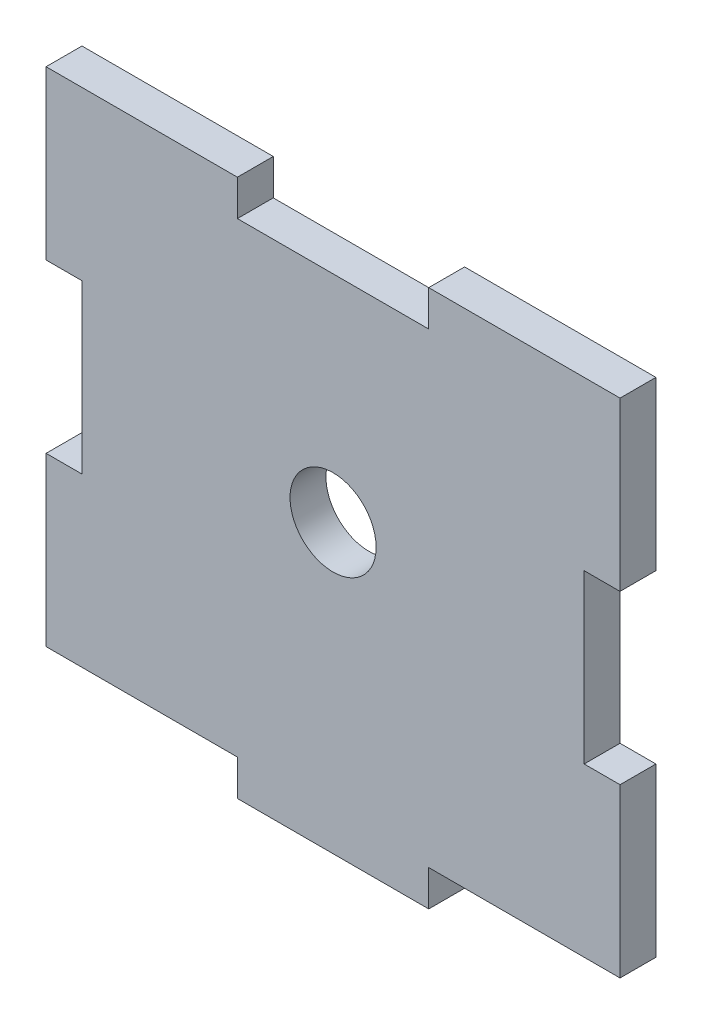
ISO-10303-21;
HEADER;
FILE_DESCRIPTION(('STEP AP214'),'2;1');
FILE_NAME('part.step','',(''),(''),'','','');
FILE_SCHEMA(('AUTOMOTIVE_DESIGN { 1 0 10303 214 1 1 1 1 }'));
ENDSEC;
DATA;
#1=APPLICATION_CONTEXT('core data for automotive mechanical design processes');
#2=APPLICATION_PROTOCOL_DEFINITION('international standard','automotive_design',2000,#1);
#3=PRODUCT_CONTEXT('',#1,'mechanical');
#4=PRODUCT('Part','Part','',(#3));
#5=PRODUCT_RELATED_PRODUCT_CATEGORY('part','',(#4));
#6=PRODUCT_DEFINITION_FORMATION('','',#4);
#7=PRODUCT_DEFINITION_CONTEXT('part definition',#1,'design');
#8=PRODUCT_DEFINITION('design','',#6,#7);
#9=PRODUCT_DEFINITION_SHAPE('','',#8);
#10=(LENGTH_UNIT() NAMED_UNIT(*) SI_UNIT(.MILLI.,.METRE.));
#11=(NAMED_UNIT(*) PLANE_ANGLE_UNIT() SI_UNIT($,.RADIAN.));
#12=(NAMED_UNIT(*) SI_UNIT($,.STERADIAN.) SOLID_ANGLE_UNIT());
#13=UNCERTAINTY_MEASURE_WITH_UNIT(LENGTH_MEASURE(1.E-05),#10,'distance_accuracy_value','');
#14=(GEOMETRIC_REPRESENTATION_CONTEXT(3) GLOBAL_UNCERTAINTY_ASSIGNED_CONTEXT((#13)) GLOBAL_UNIT_ASSIGNED_CONTEXT((#10,
#11,#12)) REPRESENTATION_CONTEXT('',''));
#15=CARTESIAN_POINT('',(0.,0.,0.));
#16=DIRECTION('',(0.,0.,1.));
#17=DIRECTION('',(1.,0.,0.));
#18=AXIS2_PLACEMENT_3D('',#15,#16,#17);
#19=CARTESIAN_POINT('',(0.,75.,5.));
#20=DIRECTION('',(0.,1.,0.));
#21=DIRECTION('',(-1.,0.,0.));
#22=AXIS2_PLACEMENT_3D('',#19,#20,#21);
#23=PLANE('',#22);
#24=DIRECTION('',(0.,0.,1.));
#25=VECTOR('',#24,1.);
#26=CARTESIAN_POINT('',(53.3333333333333,75.,-5.));
#27=LINE('',#26,#25);
#28=CARTESIAN_POINT('',(53.3333333333333,75.,0.));
#29=VERTEX_POINT('',#28);
#30=CARTESIAN_POINT('',(53.3333333333333,75.,5.));
#31=VERTEX_POINT('',#30);
#32=EDGE_CURVE('E297',#29,#31,#27,.T.);
#33=ORIENTED_EDGE('',*,*,#32,.T.);
#34=DIRECTION('',(1.,0.,0.));
#35=VECTOR('',#34,1.);
#36=CARTESIAN_POINT('',(0.,75.,5.));
#37=LINE('',#36,#35);
#38=CARTESIAN_POINT('',(80.,75.,5.));
#39=VERTEX_POINT('',#38);
#40=EDGE_CURVE('E182',#31,#39,#37,.T.);
#41=ORIENTED_EDGE('',*,*,#40,.T.);
#42=DIRECTION('',(0.,0.,-1.));
#43=VECTOR('',#42,1.);
#44=CARTESIAN_POINT('',(80.,75.,5.));
#45=LINE('',#44,#43);
#46=CARTESIAN_POINT('',(80.,75.,0.));
#47=VERTEX_POINT('',#46);
#48=EDGE_CURVE('E173',#39,#47,#45,.T.);
#49=ORIENTED_EDGE('',*,*,#48,.T.);
#50=DIRECTION('',(1.,0.,0.));
#51=VECTOR('',#50,1.);
#52=CARTESIAN_POINT('',(0.,75.,0.));
#53=LINE('',#52,#51);
#54=EDGE_CURVE('E232',#29,#47,#53,.T.);
#55=ORIENTED_EDGE('',*,*,#54,.F.);
#56=EDGE_LOOP('',(#33,#41,#49,#55));
#57=FACE_BOUND('',#56,.T.);
#58=ADVANCED_FACE('F34',(#57),#23,.T.);
#59=CARTESIAN_POINT('',(0.,0.,5.));
#60=DIRECTION('',(-1.,0.,0.));
#61=DIRECTION('',(0.,0.,1.));
#62=AXIS2_PLACEMENT_3D('',#59,#60,#61);
#63=PLANE('',#62);
#64=DIRECTION('',(0.,1.,0.));
#65=VECTOR('',#64,1.);
#66=CARTESIAN_POINT('',(0.,0.,0.));
#67=LINE('',#66,#65);
#68=CARTESIAN_POINT('',(0.,51.6666666666667,0.));
#69=VERTEX_POINT('',#68);
#70=CARTESIAN_POINT('',(0.,75.,0.));
#71=VERTEX_POINT('',#70);
#72=EDGE_CURVE('E196',#69,#71,#67,.T.);
#73=ORIENTED_EDGE('',*,*,#72,.F.);
#74=DIRECTION('',(0.,0.,-1.));
#75=VECTOR('',#74,1.);
#76=CARTESIAN_POINT('',(0.,51.6666666666667,5.));
#77=LINE('',#76,#75);
#78=CARTESIAN_POINT('',(0.,51.6666666666667,5.));
#79=VERTEX_POINT('',#78);
#80=EDGE_CURVE('E119',#79,#69,#77,.T.);
#81=ORIENTED_EDGE('',*,*,#80,.F.);
#82=DIRECTION('',(0.,1.,0.));
#83=VECTOR('',#82,1.);
#84=CARTESIAN_POINT('',(0.,0.,5.));
#85=LINE('',#84,#83);
#86=CARTESIAN_POINT('',(0.,75.,5.));
#87=VERTEX_POINT('',#86);
#88=EDGE_CURVE('E236',#79,#87,#85,.T.);
#89=ORIENTED_EDGE('',*,*,#88,.T.);
#90=DIRECTION('',(0.,0.,-1.));
#91=VECTOR('',#90,1.);
#92=CARTESIAN_POINT('',(0.,75.,5.));
#93=LINE('',#92,#91);
#94=EDGE_CURVE('E59',#87,#71,#93,.T.);
#95=ORIENTED_EDGE('',*,*,#94,.T.);
#96=EDGE_LOOP('',(#73,#81,#89,#95));
#97=FACE_BOUND('',#96,.T.);
#98=ADVANCED_FACE('F36',(#97),#63,.T.);
#99=CARTESIAN_POINT('',(0.,51.6666666666667,5.));
#100=DIRECTION('',(0.,1.,0.));
#101=DIRECTION('',(0.,0.,1.));
#102=AXIS2_PLACEMENT_3D('',#99,#100,#101);
#103=PLANE('',#102);
#104=DIRECTION('',(1.,0.,0.));
#105=VECTOR('',#104,1.);
#106=CARTESIAN_POINT('',(0.,51.6666666666667,0.));
#107=LINE('',#106,#105);
#108=CARTESIAN_POINT('',(5.,51.6666666666667,0.));
#109=VERTEX_POINT('',#108);
#110=EDGE_CURVE('E198',#69,#109,#107,.T.);
#111=ORIENTED_EDGE('',*,*,#110,.T.);
#112=DIRECTION('',(0.,0.,-1.));
#113=VECTOR('',#112,1.);
#114=CARTESIAN_POINT('',(5.,51.6666666666667,5.));
#115=LINE('',#114,#113);
#116=CARTESIAN_POINT('',(5.,51.6666666666667,5.));
#117=VERTEX_POINT('',#116);
#118=EDGE_CURVE('E264',#117,#109,#115,.T.);
#119=ORIENTED_EDGE('',*,*,#118,.F.);
#120=DIRECTION('',(1.,0.,0.));
#121=VECTOR('',#120,1.);
#122=CARTESIAN_POINT('',(0.,51.6666666666667,5.));
#123=LINE('',#122,#121);
#124=EDGE_CURVE('E301',#79,#117,#123,.T.);
#125=ORIENTED_EDGE('',*,*,#124,.F.);
#126=ORIENTED_EDGE('',*,*,#80,.T.);
#127=EDGE_LOOP('',(#111,#119,#125,#126));
#128=FACE_BOUND('',#127,.T.);
#129=ADVANCED_FACE('F350',(#128),#103,.F.);
#130=CARTESIAN_POINT('',(5.00000000000001,0.,5.));
#131=DIRECTION('',(1.,0.,0.));
#132=DIRECTION('',(0.,1.,0.));
#133=AXIS2_PLACEMENT_3D('',#130,#131,#132);
#134=PLANE('',#133);
#135=DIRECTION('',(0.,-1.,0.));
#136=VECTOR('',#135,1.);
#137=CARTESIAN_POINT('',(5.00000000000001,0.,0.));
#138=LINE('',#137,#136);
#139=CARTESIAN_POINT('',(5.,28.3333333333333,0.));
#140=VERTEX_POINT('',#139);
#141=EDGE_CURVE('E201',#109,#140,#138,.T.);
#142=ORIENTED_EDGE('',*,*,#141,.T.);
#143=DIRECTION('',(0.,0.,-1.));
#144=VECTOR('',#143,1.);
#145=CARTESIAN_POINT('',(5.,28.3333333333333,5.));
#146=LINE('',#145,#144);
#147=CARTESIAN_POINT('',(5.,28.3333333333333,5.));
#148=VERTEX_POINT('',#147);
#149=EDGE_CURVE('E262',#148,#140,#146,.T.);
#150=ORIENTED_EDGE('',*,*,#149,.F.);
#151=DIRECTION('',(0.,-1.,0.));
#152=VECTOR('',#151,1.);
#153=CARTESIAN_POINT('',(5.00000000000001,0.,5.));
#154=LINE('',#153,#152);
#155=EDGE_CURVE('E303',#117,#148,#154,.T.);
#156=ORIENTED_EDGE('',*,*,#155,.F.);
#157=ORIENTED_EDGE('',*,*,#118,.T.);
#158=EDGE_LOOP('',(#142,#150,#156,#157));
#159=FACE_BOUND('',#158,.T.);
#160=ADVANCED_FACE('F355',(#159),#134,.F.);
#161=CARTESIAN_POINT('',(0.,28.3333333333333,5.));
#162=DIRECTION('',(0.,1.,0.));
#163=DIRECTION('',(0.,0.,1.));
#164=AXIS2_PLACEMENT_3D('',#161,#162,#163);
#165=PLANE('',#164);
#166=DIRECTION('',(1.,0.,0.));
#167=VECTOR('',#166,1.);
#168=CARTESIAN_POINT('',(0.,28.3333333333333,0.));
#169=LINE('',#168,#167);
#170=CARTESIAN_POINT('',(0.,28.3333333333333,0.));
#171=VERTEX_POINT('',#170);
#172=EDGE_CURVE('E204',#171,#140,#169,.T.);
#173=ORIENTED_EDGE('',*,*,#172,.F.);
#174=DIRECTION('',(0.,0.,-1.));
#175=VECTOR('',#174,1.);
#176=CARTESIAN_POINT('',(0.,28.3333333333333,5.));
#177=LINE('',#176,#175);
#178=CARTESIAN_POINT('',(0.,28.3333333333333,5.));
#179=VERTEX_POINT('',#178);
#180=EDGE_CURVE('E260',#179,#171,#177,.T.);
#181=ORIENTED_EDGE('',*,*,#180,.F.);
#182=DIRECTION('',(1.,0.,0.));
#183=VECTOR('',#182,1.);
#184=CARTESIAN_POINT('',(0.,28.3333333333333,5.));
#185=LINE('',#184,#183);
#186=EDGE_CURVE('E305',#179,#148,#185,.T.);
#187=ORIENTED_EDGE('',*,*,#186,.T.);
#188=ORIENTED_EDGE('',*,*,#149,.T.);
#189=EDGE_LOOP('',(#173,#181,#187,#188));
#190=FACE_BOUND('',#189,.T.);
#191=ADVANCED_FACE('F402',(#190),#165,.T.);
#192=CARTESIAN_POINT('',(0.,0.,5.));
#193=DIRECTION('',(-1.,0.,0.));
#194=DIRECTION('',(0.,0.,1.));
#195=AXIS2_PLACEMENT_3D('',#192,#193,#194);
#196=PLANE('',#195);
#197=DIRECTION('',(0.,1.,0.));
#198=VECTOR('',#197,1.);
#199=CARTESIAN_POINT('',(0.,0.,0.));
#200=LINE('',#199,#198);
#201=CARTESIAN_POINT('',(0.,5.,0.));
#202=VERTEX_POINT('',#201);
#203=EDGE_CURVE('E207',#202,#171,#200,.T.);
#204=ORIENTED_EDGE('',*,*,#203,.F.);
#205=DIRECTION('',(0.,0.,-1.));
#206=VECTOR('',#205,1.);
#207=CARTESIAN_POINT('',(0.,5.,5.));
#208=LINE('',#207,#206);
#209=CARTESIAN_POINT('',(0.,5.,5.));
#210=VERTEX_POINT('',#209);
#211=EDGE_CURVE('E258',#210,#202,#208,.T.);
#212=ORIENTED_EDGE('',*,*,#211,.F.);
#213=DIRECTION('',(0.,1.,0.));
#214=VECTOR('',#213,1.);
#215=CARTESIAN_POINT('',(0.,0.,5.));
#216=LINE('',#215,#214);
#217=EDGE_CURVE('E308',#210,#179,#216,.T.);
#218=ORIENTED_EDGE('',*,*,#217,.T.);
#219=ORIENTED_EDGE('',*,*,#180,.T.);
#220=EDGE_LOOP('',(#204,#212,#218,#219));
#221=FACE_BOUND('',#220,.T.);
#222=ADVANCED_FACE('F399',(#221),#196,.T.);
#223=CARTESIAN_POINT('',(0.,5.,5.));
#224=DIRECTION('',(0.,1.,0.));
#225=DIRECTION('',(0.,0.,1.));
#226=AXIS2_PLACEMENT_3D('',#223,#224,#225);
#227=PLANE('',#226);
#228=DIRECTION('',(1.,0.,0.));
#229=VECTOR('',#228,1.);
#230=CARTESIAN_POINT('',(0.,5.,0.));
#231=LINE('',#230,#229);
#232=CARTESIAN_POINT('',(26.6666666666667,5.,0.));
#233=VERTEX_POINT('',#232);
#234=EDGE_CURVE('E210',#202,#233,#231,.T.);
#235=ORIENTED_EDGE('',*,*,#234,.T.);
#236=DIRECTION('',(0.,0.,-1.));
#237=VECTOR('',#236,1.);
#238=CARTESIAN_POINT('',(26.6666666666667,5.,5.));
#239=LINE('',#238,#237);
#240=CARTESIAN_POINT('',(26.6666666666667,5.,5.));
#241=VERTEX_POINT('',#240);
#242=EDGE_CURVE('E255',#241,#233,#239,.T.);
#243=ORIENTED_EDGE('',*,*,#242,.F.);
#244=DIRECTION('',(1.,0.,0.));
#245=VECTOR('',#244,1.);
#246=CARTESIAN_POINT('',(0.,5.,5.));
#247=LINE('',#246,#245);
#248=EDGE_CURVE('E311',#210,#241,#247,.T.);
#249=ORIENTED_EDGE('',*,*,#248,.F.);
#250=ORIENTED_EDGE('',*,*,#211,.T.);
#251=EDGE_LOOP('',(#235,#243,#249,#250));
#252=FACE_BOUND('',#251,.T.);
#253=ADVANCED_FACE('F387',(#252),#227,.F.);
#254=CARTESIAN_POINT('',(26.6666666666667,0.,5.));
#255=DIRECTION('',(1.,0.,0.));
#256=DIRECTION('',(0.,0.,-1.));
#257=AXIS2_PLACEMENT_3D('',#254,#255,#256);
#258=PLANE('',#257);
#259=DIRECTION('',(0.,-1.,0.));
#260=VECTOR('',#259,1.);
#261=CARTESIAN_POINT('',(26.6666666666667,0.,0.));
#262=LINE('',#261,#260);
#263=CARTESIAN_POINT('',(26.6666666666667,0.,0.));
#264=VERTEX_POINT('',#263);
#265=EDGE_CURVE('E212',#233,#264,#262,.T.);
#266=ORIENTED_EDGE('',*,*,#265,.T.);
#267=DIRECTION('',(0.,0.,-1.));
#268=VECTOR('',#267,1.);
#269=CARTESIAN_POINT('',(26.6666666666667,0.,5.));
#270=LINE('',#269,#268);
#271=CARTESIAN_POINT('',(26.6666666666667,0.,5.));
#272=VERTEX_POINT('',#271);
#273=EDGE_CURVE('E252',#272,#264,#270,.T.);
#274=ORIENTED_EDGE('',*,*,#273,.F.);
#275=DIRECTION('',(0.,-1.,0.));
#276=VECTOR('',#275,1.);
#277=CARTESIAN_POINT('',(26.6666666666667,0.,5.));
#278=LINE('',#277,#276);
#279=EDGE_CURVE('E313',#241,#272,#278,.T.);
#280=ORIENTED_EDGE('',*,*,#279,.F.);
#281=ORIENTED_EDGE('',*,*,#242,.T.);
#282=EDGE_LOOP('',(#266,#274,#280,#281));
#283=FACE_BOUND('',#282,.T.);
#284=ADVANCED_FACE('F394',(#283),#258,.F.);
#285=CARTESIAN_POINT('',(0.,0.,5.));
#286=DIRECTION('',(0.,1.,0.));
#287=DIRECTION('',(0.,0.,1.));
#288=AXIS2_PLACEMENT_3D('',#285,#286,#287);
#289=PLANE('',#288);
#290=DIRECTION('',(1.,0.,0.));
#291=VECTOR('',#290,1.);
#292=CARTESIAN_POINT('',(0.,0.,0.));
#293=LINE('',#292,#291);
#294=CARTESIAN_POINT('',(53.3333333333333,0.,0.));
#295=VERTEX_POINT('',#294);
#296=EDGE_CURVE('E215',#264,#295,#293,.T.);
#297=ORIENTED_EDGE('',*,*,#296,.T.);
#298=DIRECTION('',(0.,0.,-1.));
#299=VECTOR('',#298,1.);
#300=CARTESIAN_POINT('',(53.3333333333333,0.,5.));
#301=LINE('',#300,#299);
#302=CARTESIAN_POINT('',(53.3333333333333,0.,5.));
#303=VERTEX_POINT('',#302);
#304=EDGE_CURVE('E250',#303,#295,#301,.T.);
#305=ORIENTED_EDGE('',*,*,#304,.F.);
#306=DIRECTION('',(1.,0.,0.));
#307=VECTOR('',#306,1.);
#308=CARTESIAN_POINT('',(0.,0.,5.));
#309=LINE('',#308,#307);
#310=EDGE_CURVE('E316',#272,#303,#309,.T.);
#311=ORIENTED_EDGE('',*,*,#310,.F.);
#312=ORIENTED_EDGE('',*,*,#273,.T.);
#313=EDGE_LOOP('',(#297,#305,#311,#312));
#314=FACE_BOUND('',#313,.T.);
#315=ADVANCED_FACE('F390',(#314),#289,.F.);
#316=CARTESIAN_POINT('',(53.3333333333333,0.,5.));
#317=DIRECTION('',(1.,0.,0.));
#318=DIRECTION('',(0.,0.,-1.));
#319=AXIS2_PLACEMENT_3D('',#316,#317,#318);
#320=PLANE('',#319);
#321=DIRECTION('',(0.,-1.,0.));
#322=VECTOR('',#321,1.);
#323=CARTESIAN_POINT('',(53.3333333333333,0.,0.));
#324=LINE('',#323,#322);
#325=CARTESIAN_POINT('',(53.3333333333333,5.,0.));
#326=VERTEX_POINT('',#325);
#327=EDGE_CURVE('E218',#326,#295,#324,.T.);
#328=ORIENTED_EDGE('',*,*,#327,.F.);
#329=DIRECTION('',(0.,0.,-1.));
#330=VECTOR('',#329,1.);
#331=CARTESIAN_POINT('',(53.3333333333333,5.,5.));
#332=LINE('',#331,#330);
#333=CARTESIAN_POINT('',(53.3333333333333,5.,5.));
#334=VERTEX_POINT('',#333);
#335=EDGE_CURVE('E248',#334,#326,#332,.T.);
#336=ORIENTED_EDGE('',*,*,#335,.F.);
#337=DIRECTION('',(0.,-1.,0.));
#338=VECTOR('',#337,1.);
#339=CARTESIAN_POINT('',(53.3333333333333,0.,5.));
#340=LINE('',#339,#338);
#341=EDGE_CURVE('E318',#334,#303,#340,.T.);
#342=ORIENTED_EDGE('',*,*,#341,.T.);
#343=ORIENTED_EDGE('',*,*,#304,.T.);
#344=EDGE_LOOP('',(#328,#336,#342,#343));
#345=FACE_BOUND('',#344,.T.);
#346=ADVANCED_FACE('F385',(#345),#320,.T.);
#347=CARTESIAN_POINT('',(80.,5.,0.));
#348=VERTEX_POINT('',#347);
#349=EDGE_CURVE('E213',#326,#348,#231,.T.);
#350=ORIENTED_EDGE('',*,*,#349,.T.);
#351=DIRECTION('',(0.,0.,-1.));
#352=VECTOR('',#351,1.);
#353=CARTESIAN_POINT('',(80.,5.,5.));
#354=LINE('',#353,#352);
#355=CARTESIAN_POINT('',(80.,5.,5.));
#356=VERTEX_POINT('',#355);
#357=EDGE_CURVE('E245',#356,#348,#354,.T.);
#358=ORIENTED_EDGE('',*,*,#357,.F.);
#359=EDGE_CURVE('E314',#334,#356,#247,.T.);
#360=ORIENTED_EDGE('',*,*,#359,.F.);
#361=ORIENTED_EDGE('',*,*,#335,.T.);
#362=EDGE_LOOP('',(#350,#358,#360,#361));
#363=FACE_BOUND('',#362,.T.);
#364=ADVANCED_FACE('F381',(#363),#227,.F.);
#365=CARTESIAN_POINT('',(80.,0.,5.));
#366=DIRECTION('',(-1.,0.,0.));
#367=DIRECTION('',(0.,0.,1.));
#368=AXIS2_PLACEMENT_3D('',#365,#366,#367);
#369=PLANE('',#368);
#370=DIRECTION('',(0.,1.,0.));
#371=VECTOR('',#370,1.);
#372=CARTESIAN_POINT('',(80.,0.,0.));
#373=LINE('',#372,#371);
#374=CARTESIAN_POINT('',(80.,28.3333333333333,0.));
#375=VERTEX_POINT('',#374);
#376=EDGE_CURVE('E221',#348,#375,#373,.T.);
#377=ORIENTED_EDGE('',*,*,#376,.T.);
#378=DIRECTION('',(0.,0.,-1.));
#379=VECTOR('',#378,1.);
#380=CARTESIAN_POINT('',(80.,28.3333333333333,5.));
#381=LINE('',#380,#379);
#382=CARTESIAN_POINT('',(80.,28.3333333333333,5.));
#383=VERTEX_POINT('',#382);
#384=EDGE_CURVE('E242',#383,#375,#381,.T.);
#385=ORIENTED_EDGE('',*,*,#384,.F.);
#386=DIRECTION('',(0.,1.,0.));
#387=VECTOR('',#386,1.);
#388=CARTESIAN_POINT('',(80.,0.,5.));
#389=LINE('',#388,#387);
#390=EDGE_CURVE('E321',#356,#383,#389,.T.);
#391=ORIENTED_EDGE('',*,*,#390,.F.);
#392=ORIENTED_EDGE('',*,*,#357,.T.);
#393=EDGE_LOOP('',(#377,#385,#391,#392));
#394=FACE_BOUND('',#393,.T.);
#395=ADVANCED_FACE('F378',(#394),#369,.F.);
#396=CARTESIAN_POINT('',(0.,28.3333333333333,5.));
#397=DIRECTION('',(0.,-1.,0.));
#398=DIRECTION('',(1.,0.,0.));
#399=AXIS2_PLACEMENT_3D('',#396,#397,#398);
#400=PLANE('',#399);
#401=DIRECTION('',(-1.,0.,0.));
#402=VECTOR('',#401,1.);
#403=CARTESIAN_POINT('',(0.,28.3333333333333,0.));
#404=LINE('',#403,#402);
#405=CARTESIAN_POINT('',(75.,28.3333333333333,0.));
#406=VERTEX_POINT('',#405);
#407=EDGE_CURVE('E223',#375,#406,#404,.T.);
#408=ORIENTED_EDGE('',*,*,#407,.T.);
#409=DIRECTION('',(0.,0.,-1.));
#410=VECTOR('',#409,1.);
#411=CARTESIAN_POINT('',(75.,28.3333333333333,5.));
#412=LINE('',#411,#410);
#413=CARTESIAN_POINT('',(75.,28.3333333333333,5.));
#414=VERTEX_POINT('',#413);
#415=EDGE_CURVE('E240',#414,#406,#412,.T.);
#416=ORIENTED_EDGE('',*,*,#415,.F.);
#417=DIRECTION('',(-1.,0.,0.));
#418=VECTOR('',#417,1.);
#419=CARTESIAN_POINT('',(0.,28.3333333333333,5.));
#420=LINE('',#419,#418);
#421=EDGE_CURVE('E190',#383,#414,#420,.T.);
#422=ORIENTED_EDGE('',*,*,#421,.F.);
#423=ORIENTED_EDGE('',*,*,#384,.T.);
#424=EDGE_LOOP('',(#408,#416,#422,#423));
#425=FACE_BOUND('',#424,.T.);
#426=ADVANCED_FACE('F327',(#425),#400,.F.);
#427=CARTESIAN_POINT('',(75.,0.,5.));
#428=DIRECTION('',(1.,0.,0.));
#429=DIRECTION('',(0.,1.,0.));
#430=AXIS2_PLACEMENT_3D('',#427,#428,#429);
#431=PLANE('',#430);
#432=DIRECTION('',(0.,-1.,0.));
#433=VECTOR('',#432,1.);
#434=CARTESIAN_POINT('',(75.,0.,0.));
#435=LINE('',#434,#433);
#436=CARTESIAN_POINT('',(75.,51.6666666666667,0.));
#437=VERTEX_POINT('',#436);
#438=EDGE_CURVE('E226',#437,#406,#435,.T.);
#439=ORIENTED_EDGE('',*,*,#438,.F.);
#440=DIRECTION('',(0.,0.,-1.));
#441=VECTOR('',#440,1.);
#442=CARTESIAN_POINT('',(75.,51.6666666666667,5.));
#443=LINE('',#442,#441);
#444=CARTESIAN_POINT('',(75.,51.6666666666667,5.));
#445=VERTEX_POINT('',#444);
#446=EDGE_CURVE('E172',#445,#437,#443,.T.);
#447=ORIENTED_EDGE('',*,*,#446,.F.);
#448=DIRECTION('',(0.,-1.,0.));
#449=VECTOR('',#448,1.);
#450=CARTESIAN_POINT('',(75.,0.,5.));
#451=LINE('',#450,#449);
#452=EDGE_CURVE('E188',#445,#414,#451,.T.);
#453=ORIENTED_EDGE('',*,*,#452,.T.);
#454=ORIENTED_EDGE('',*,*,#415,.T.);
#455=EDGE_LOOP('',(#439,#447,#453,#454));
#456=FACE_BOUND('',#455,.T.);
#457=ADVANCED_FACE('F331',(#456),#431,.T.);
#458=CARTESIAN_POINT('',(0.,51.6666666666667,5.));
#459=DIRECTION('',(0.,-1.,0.));
#460=DIRECTION('',(0.,0.,-1.));
#461=AXIS2_PLACEMENT_3D('',#458,#459,#460);
#462=PLANE('',#461);
#463=DIRECTION('',(-1.,0.,0.));
#464=VECTOR('',#463,1.);
#465=CARTESIAN_POINT('',(0.,51.6666666666667,0.));
#466=LINE('',#465,#464);
#467=CARTESIAN_POINT('',(80.,51.6666666666667,0.));
#468=VERTEX_POINT('',#467);
#469=EDGE_CURVE('E168',#468,#437,#466,.T.);
#470=ORIENTED_EDGE('',*,*,#469,.F.);
#471=DIRECTION('',(0.,0.,-1.));
#472=VECTOR('',#471,1.);
#473=CARTESIAN_POINT('',(80.,51.6666666666667,5.));
#474=LINE('',#473,#472);
#475=CARTESIAN_POINT('',(80.,51.6666666666667,5.));
#476=VERTEX_POINT('',#475);
#477=EDGE_CURVE('E162',#476,#468,#474,.T.);
#478=ORIENTED_EDGE('',*,*,#477,.F.);
#479=DIRECTION('',(-1.,0.,0.));
#480=VECTOR('',#479,1.);
#481=CARTESIAN_POINT('',(0.,51.6666666666667,5.));
#482=LINE('',#481,#480);
#483=EDGE_CURVE('E166',#476,#445,#482,.T.);
#484=ORIENTED_EDGE('',*,*,#483,.T.);
#485=ORIENTED_EDGE('',*,*,#446,.T.);
#486=EDGE_LOOP('',(#470,#478,#484,#485));
#487=FACE_BOUND('',#486,.T.);
#488=ADVANCED_FACE('F164',(#487),#462,.T.);
#489=CARTESIAN_POINT('',(80.,0.,5.));
#490=DIRECTION('',(-1.,0.,0.));
#491=DIRECTION('',(0.,0.,1.));
#492=AXIS2_PLACEMENT_3D('',#489,#490,#491);
#493=PLANE('',#492);
#494=DIRECTION('',(0.,1.,0.));
#495=VECTOR('',#494,1.);
#496=CARTESIAN_POINT('',(80.,0.,0.));
#497=LINE('',#496,#495);
#498=EDGE_CURVE('E230',#468,#47,#497,.T.);
#499=ORIENTED_EDGE('',*,*,#498,.T.);
#500=ORIENTED_EDGE('',*,*,#48,.F.);
#501=DIRECTION('',(0.,1.,0.));
#502=VECTOR('',#501,1.);
#503=CARTESIAN_POINT('',(80.,0.,5.));
#504=LINE('',#503,#502);
#505=EDGE_CURVE('E177',#476,#39,#504,.T.);
#506=ORIENTED_EDGE('',*,*,#505,.F.);
#507=ORIENTED_EDGE('',*,*,#477,.T.);
#508=EDGE_LOOP('',(#499,#500,#506,#507));
#509=FACE_BOUND('',#508,.T.);
#510=ADVANCED_FACE('F178',(#509),#493,.F.);
#511=DIRECTION('',(0.,0.,1.));
#512=VECTOR('',#511,1.);
#513=CARTESIAN_POINT('',(26.6666666666667,75.,-5.));
#514=LINE('',#513,#512);
#515=CARTESIAN_POINT('',(26.6666666666667,75.,0.));
#516=VERTEX_POINT('',#515);
#517=CARTESIAN_POINT('',(26.6666666666667,75.,5.));
#518=VERTEX_POINT('',#517);
#519=EDGE_CURVE('E290',#516,#518,#514,.T.);
#520=ORIENTED_EDGE('',*,*,#519,.F.);
#521=EDGE_CURVE('E233',#71,#516,#53,.T.);
#522=ORIENTED_EDGE('',*,*,#521,.F.);
#523=ORIENTED_EDGE('',*,*,#94,.F.);
#524=EDGE_CURVE('E194',#87,#518,#37,.T.);
#525=ORIENTED_EDGE('',*,*,#524,.T.);
#526=EDGE_LOOP('',(#520,#522,#523,#525));
#527=FACE_BOUND('',#526,.T.);
#528=ADVANCED_FACE('F345',(#527),#23,.T.);
#529=CARTESIAN_POINT('',(0.,0.,5.));
#530=DIRECTION('',(0.,0.,1.));
#531=DIRECTION('',(1.,0.,0.));
#532=AXIS2_PLACEMENT_3D('',#529,#530,#531);
#533=PLANE('',#532);
#534=CARTESIAN_POINT('',(40.,40.,5.));
#535=DIRECTION('',(0.,0.,1.));
#536=DIRECTION('',(1.,0.,0.));
#537=AXIS2_PLACEMENT_3D('',#534,#535,#536);
#538=CIRCLE('',#537,6.);
#539=CARTESIAN_POINT('',(46.,40.,5.));
#540=VERTEX_POINT('',#539);
#541=EDGE_CURVE('E545',#540,#540,#538,.T.);
#542=ORIENTED_EDGE('',*,*,#541,.F.);
#543=EDGE_LOOP('',(#542));
#544=FACE_BOUND('',#543,.T.);
#545=DIRECTION('',(0.,1.,0.));
#546=VECTOR('',#545,1.);
#547=CARTESIAN_POINT('',(53.3333333333333,75.,5.));
#548=LINE('',#547,#546);
#549=CARTESIAN_POINT('',(53.3333333333333,70.,5.));
#550=VERTEX_POINT('',#549);
#551=EDGE_CURVE('E335',#550,#31,#548,.T.);
#552=ORIENTED_EDGE('',*,*,#551,.F.);
#553=DIRECTION('',(1.,0.,0.));
#554=VECTOR('',#553,1.);
#555=CARTESIAN_POINT('',(53.3333333333333,70.,5.));
#556=LINE('',#555,#554);
#557=CARTESIAN_POINT('',(26.6666666666667,70.,5.));
#558=VERTEX_POINT('',#557);
#559=EDGE_CURVE('E286',#558,#550,#556,.T.);
#560=ORIENTED_EDGE('',*,*,#559,.F.);
#561=DIRECTION('',(0.,-1.,0.));
#562=VECTOR('',#561,1.);
#563=CARTESIAN_POINT('',(26.6666666666667,75.,5.));
#564=LINE('',#563,#562);
#565=EDGE_CURVE('E548',#518,#558,#564,.T.);
#566=ORIENTED_EDGE('',*,*,#565,.F.);
#567=ORIENTED_EDGE('',*,*,#524,.F.);
#568=ORIENTED_EDGE('',*,*,#88,.F.);
#569=ORIENTED_EDGE('',*,*,#124,.T.);
#570=ORIENTED_EDGE('',*,*,#155,.T.);
#571=ORIENTED_EDGE('',*,*,#186,.F.);
#572=ORIENTED_EDGE('',*,*,#217,.F.);
#573=ORIENTED_EDGE('',*,*,#248,.T.);
#574=ORIENTED_EDGE('',*,*,#279,.T.);
#575=ORIENTED_EDGE('',*,*,#310,.T.);
#576=ORIENTED_EDGE('',*,*,#341,.F.);
#577=ORIENTED_EDGE('',*,*,#359,.T.);
#578=ORIENTED_EDGE('',*,*,#390,.T.);
#579=ORIENTED_EDGE('',*,*,#421,.T.);
#580=ORIENTED_EDGE('',*,*,#452,.F.);
#581=ORIENTED_EDGE('',*,*,#483,.F.);
#582=ORIENTED_EDGE('',*,*,#505,.T.);
#583=ORIENTED_EDGE('',*,*,#40,.F.);
#584=EDGE_LOOP('',(#552,#560,#566,#567,#568,#569,#570,#571,#572,#573,#574,#575,#576,#577,#578,
#579,#580,#581,#582,#583));
#585=FACE_BOUND('',#584,.T.);
#586=ADVANCED_FACE('F186',(#544,#585),#533,.T.);
#587=CARTESIAN_POINT('',(0.,0.,0.));
#588=DIRECTION('',(0.,0.,1.));
#589=DIRECTION('',(1.,0.,0.));
#590=AXIS2_PLACEMENT_3D('',#587,#588,#589);
#591=PLANE('',#590);
#592=CARTESIAN_POINT('',(40.,40.,0.));
#593=DIRECTION('',(0.,0.,1.));
#594=DIRECTION('',(1.,0.,0.));
#595=AXIS2_PLACEMENT_3D('',#592,#593,#594);
#596=CIRCLE('',#595,6.);
#597=CARTESIAN_POINT('',(46.,40.,0.));
#598=VERTEX_POINT('',#597);
#599=EDGE_CURVE('E38',#598,#598,#596,.T.);
#600=ORIENTED_EDGE('',*,*,#599,.T.);
#601=EDGE_LOOP('',(#600));
#602=FACE_BOUND('',#601,.T.);
#603=DIRECTION('',(1.,0.,0.));
#604=VECTOR('',#603,1.);
#605=CARTESIAN_POINT('',(0.,70.,0.));
#606=LINE('',#605,#604);
#607=CARTESIAN_POINT('',(26.6666666666667,70.,0.));
#608=VERTEX_POINT('',#607);
#609=CARTESIAN_POINT('',(53.3333333333333,70.,0.));
#610=VERTEX_POINT('',#609);
#611=EDGE_CURVE('E43',#608,#610,#606,.T.);
#612=ORIENTED_EDGE('',*,*,#611,.T.);
#613=DIRECTION('',(0.,1.,0.));
#614=VECTOR('',#613,1.);
#615=CARTESIAN_POINT('',(53.3333333333333,0.,0.));
#616=LINE('',#615,#614);
#617=EDGE_CURVE('E11',#610,#29,#616,.T.);
#618=ORIENTED_EDGE('',*,*,#617,.T.);
#619=ORIENTED_EDGE('',*,*,#54,.T.);
#620=ORIENTED_EDGE('',*,*,#498,.F.);
#621=ORIENTED_EDGE('',*,*,#469,.T.);
#622=ORIENTED_EDGE('',*,*,#438,.T.);
#623=ORIENTED_EDGE('',*,*,#407,.F.);
#624=ORIENTED_EDGE('',*,*,#376,.F.);
#625=ORIENTED_EDGE('',*,*,#349,.F.);
#626=ORIENTED_EDGE('',*,*,#327,.T.);
#627=ORIENTED_EDGE('',*,*,#296,.F.);
#628=ORIENTED_EDGE('',*,*,#265,.F.);
#629=ORIENTED_EDGE('',*,*,#234,.F.);
#630=ORIENTED_EDGE('',*,*,#203,.T.);
#631=ORIENTED_EDGE('',*,*,#172,.T.);
#632=ORIENTED_EDGE('',*,*,#141,.F.);
#633=ORIENTED_EDGE('',*,*,#110,.F.);
#634=ORIENTED_EDGE('',*,*,#72,.T.);
#635=ORIENTED_EDGE('',*,*,#521,.T.);
#636=DIRECTION('',(0.,-1.,0.));
#637=VECTOR('',#636,1.);
#638=CARTESIAN_POINT('',(26.6666666666667,0.,0.));
#639=LINE('',#638,#637);
#640=EDGE_CURVE('E268',#516,#608,#639,.T.);
#641=ORIENTED_EDGE('',*,*,#640,.T.);
#642=EDGE_LOOP('',(#612,#618,#619,#620,#621,#622,#623,#624,#625,#626,#627,#628,#629,#630,#631,
#632,#633,#634,#635,#641));
#643=FACE_BOUND('',#642,.T.);
#644=ADVANCED_FACE('F273',(#602,#643),#591,.F.);
#645=CARTESIAN_POINT('',(53.3333333333333,75.,-5.));
#646=DIRECTION('',(1.,0.,0.));
#647=DIRECTION('',(0.,0.,-1.));
#648=AXIS2_PLACEMENT_3D('',#645,#646,#647);
#649=PLANE('',#648);
#650=DIRECTION('',(0.,0.,1.));
#651=VECTOR('',#650,1.);
#652=CARTESIAN_POINT('',(53.3333333333333,70.,-5.));
#653=LINE('',#652,#651);
#654=EDGE_CURVE('E199',#610,#550,#653,.T.);
#655=ORIENTED_EDGE('',*,*,#654,.T.);
#656=ORIENTED_EDGE('',*,*,#551,.T.);
#657=ORIENTED_EDGE('',*,*,#32,.F.);
#658=ORIENTED_EDGE('',*,*,#617,.F.);
#659=EDGE_LOOP('',(#655,#656,#657,#658));
#660=FACE_BOUND('',#659,.T.);
#661=ADVANCED_FACE('F492',(#660),#649,.F.);
#662=CARTESIAN_POINT('',(53.3333333333333,70.,-5.));
#663=DIRECTION('',(0.,-1.,0.));
#664=DIRECTION('',(0.,0.,-1.));
#665=AXIS2_PLACEMENT_3D('',#662,#663,#664);
#666=PLANE('',#665);
#667=DIRECTION('',(0.,0.,1.));
#668=VECTOR('',#667,1.);
#669=CARTESIAN_POINT('',(26.6666666666667,70.,-5.));
#670=LINE('',#669,#668);
#671=EDGE_CURVE('E50',#608,#558,#670,.T.);
#672=ORIENTED_EDGE('',*,*,#671,.T.);
#673=ORIENTED_EDGE('',*,*,#559,.T.);
#674=ORIENTED_EDGE('',*,*,#654,.F.);
#675=ORIENTED_EDGE('',*,*,#611,.F.);
#676=EDGE_LOOP('',(#672,#673,#674,#675));
#677=FACE_BOUND('',#676,.T.);
#678=ADVANCED_FACE('F280',(#677),#666,.F.);
#679=CARTESIAN_POINT('',(26.6666666666667,75.,-5.));
#680=DIRECTION('',(-1.,0.,0.));
#681=DIRECTION('',(0.,0.,1.));
#682=AXIS2_PLACEMENT_3D('',#679,#680,#681);
#683=PLANE('',#682);
#684=ORIENTED_EDGE('',*,*,#519,.T.);
#685=ORIENTED_EDGE('',*,*,#565,.T.);
#686=ORIENTED_EDGE('',*,*,#671,.F.);
#687=ORIENTED_EDGE('',*,*,#640,.F.);
#688=EDGE_LOOP('',(#684,#685,#686,#687));
#689=FACE_BOUND('',#688,.T.);
#690=ADVANCED_FACE('F343',(#689),#683,.F.);
#691=CARTESIAN_POINT('',(40.,40.,-5.));
#692=DIRECTION('',(0.,0.,1.));
#693=DIRECTION('',(1.,0.,0.));
#694=AXIS2_PLACEMENT_3D('',#691,#692,#693);
#695=CYLINDRICAL_SURFACE('',#694,6.);
#696=ORIENTED_EDGE('',*,*,#541,.T.);
#697=EDGE_LOOP('',(#696));
#698=FACE_BOUND('',#697,.T.);
#699=ORIENTED_EDGE('',*,*,#599,.F.);
#700=EDGE_LOOP('',(#699));
#701=FACE_BOUND('',#700,.T.);
#702=ADVANCED_FACE('F513',(#698,#701),#695,.F.);
#703=CLOSED_SHELL('',(#58,#98,#129,#160,#191,#222,#253,#284,#315,#346,#364,#395,#426,#457,#488,
#510,#528,#586,#644,#661,#678,#690,#702));
#704=MANIFOLD_SOLID_BREP('B2',#703);
#705=ADVANCED_BREP_SHAPE_REPRESENTATION('',(#18,#704),#14);
#706=SHAPE_DEFINITION_REPRESENTATION(#9,#705);
ENDSEC;
END-ISO-10303-21;
